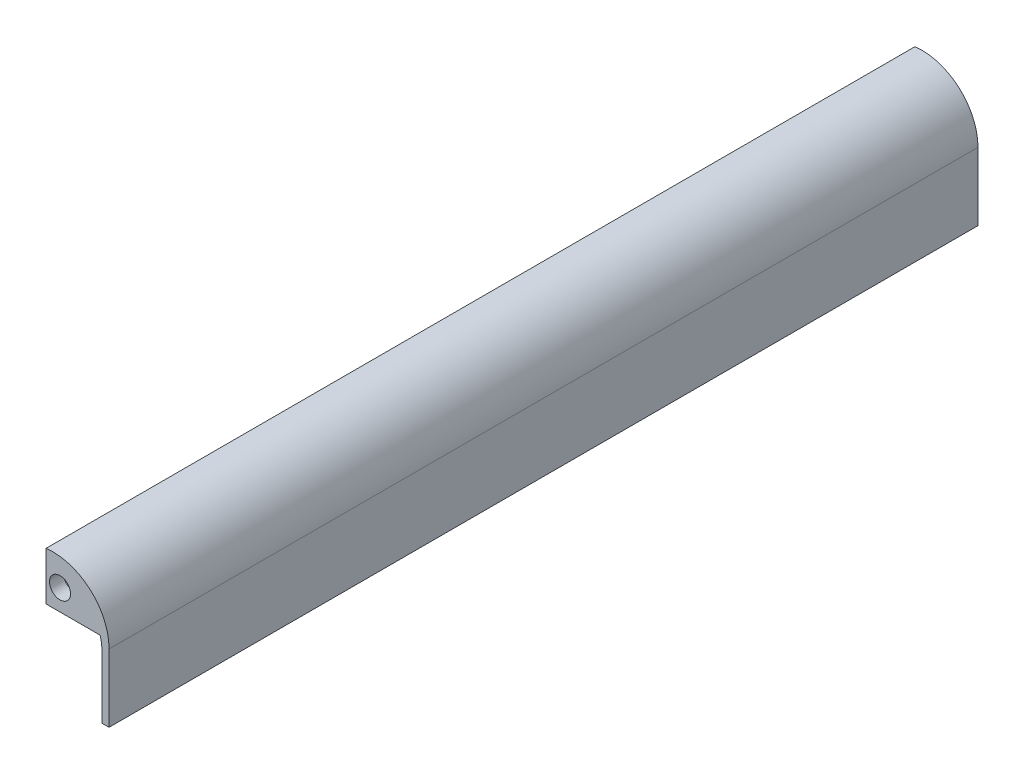
ISO-10303-21;
HEADER;
FILE_DESCRIPTION(('STEP AP214'),'2;1');
FILE_NAME('part.step','',(''),(''),'','','');
FILE_SCHEMA(('AUTOMOTIVE_DESIGN { 1 0 10303 214 1 1 1 1 }'));
ENDSEC;
DATA;
#1=APPLICATION_CONTEXT('core data for automotive mechanical design processes');
#2=APPLICATION_PROTOCOL_DEFINITION('international standard','automotive_design',2000,#1);
#3=PRODUCT_CONTEXT('',#1,'mechanical');
#4=PRODUCT('Part','Part','',(#3));
#5=PRODUCT_RELATED_PRODUCT_CATEGORY('part','',(#4));
#6=PRODUCT_DEFINITION_FORMATION('','',#4);
#7=PRODUCT_DEFINITION_CONTEXT('part definition',#1,'design');
#8=PRODUCT_DEFINITION('design','',#6,#7);
#9=PRODUCT_DEFINITION_SHAPE('','',#8);
#10=(LENGTH_UNIT() NAMED_UNIT(*) SI_UNIT(.MILLI.,.METRE.));
#11=(NAMED_UNIT(*) PLANE_ANGLE_UNIT() SI_UNIT($,.RADIAN.));
#12=(NAMED_UNIT(*) SI_UNIT($,.STERADIAN.) SOLID_ANGLE_UNIT());
#13=UNCERTAINTY_MEASURE_WITH_UNIT(LENGTH_MEASURE(1.E-05),#10,'distance_accuracy_value','');
#14=(GEOMETRIC_REPRESENTATION_CONTEXT(3) GLOBAL_UNCERTAINTY_ASSIGNED_CONTEXT((#13)) GLOBAL_UNIT_ASSIGNED_CONTEXT((#10,
#11,#12)) REPRESENTATION_CONTEXT('',''));
#15=CARTESIAN_POINT('',(0.,0.,0.));
#16=DIRECTION('',(0.,0.,1.));
#17=DIRECTION('',(1.,0.,0.));
#18=AXIS2_PLACEMENT_3D('',#15,#16,#17);
#19=CARTESIAN_POINT('',(0.,-114.3,1574.8));
#20=DIRECTION('',(0.,0.,-1.));
#21=DIRECTION('',(-1.,0.,0.));
#22=AXIS2_PLACEMENT_3D('',#19,#20,#21);
#23=CYLINDRICAL_SURFACE('',#22,101.6);
#24=CARTESIAN_POINT('',(0.,-114.3,1574.8));
#25=DIRECTION('',(0.,0.,1.));
#26=DIRECTION('',(1.,0.,0.));
#27=AXIS2_PLACEMENT_3D('',#24,#25,#26);
#28=CIRCLE('',#27,101.6);
#29=CARTESIAN_POINT('',(101.6,-114.3,1574.8));
#30=VERTEX_POINT('',#29);
#31=CARTESIAN_POINT('',(98.1456966537716,-88.0324872067063,1574.8));
#32=VERTEX_POINT('',#31);
#33=EDGE_CURVE('E150',#30,#32,#28,.T.);
#34=ORIENTED_EDGE('',*,*,#33,.T.);
#35=DIRECTION('',(0.,0.,-1.));
#36=VECTOR('',#35,1.);
#37=CARTESIAN_POINT('',(98.1456966537716,-88.0324872067063,1574.8));
#38=LINE('',#37,#36);
#39=CARTESIAN_POINT('',(98.1456966537716,-88.0324872067063,1549.4));
#40=VERTEX_POINT('',#39);
#41=EDGE_CURVE('E48',#32,#40,#38,.T.);
#42=ORIENTED_EDGE('',*,*,#41,.T.);
#43=CARTESIAN_POINT('',(0.,-114.3,1549.4));
#44=DIRECTION('',(0.,0.,-1.));
#45=DIRECTION('',(-1.,0.,0.));
#46=AXIS2_PLACEMENT_3D('',#43,#44,#45);
#47=CIRCLE('',#46,101.6);
#48=CARTESIAN_POINT('',(0.,-12.7,1549.4));
#49=VERTEX_POINT('',#48);
#50=EDGE_CURVE('E52',#49,#40,#47,.T.);
#51=ORIENTED_EDGE('',*,*,#50,.F.);
#52=DIRECTION('',(0.,0.,-1.));
#53=VECTOR('',#52,1.);
#54=CARTESIAN_POINT('',(0.,-12.7,1574.8));
#55=LINE('',#54,#53);
#56=CARTESIAN_POINT('',(0.,-12.7,25.4));
#57=VERTEX_POINT('',#56);
#58=EDGE_CURVE('E125',#49,#57,#55,.T.);
#59=ORIENTED_EDGE('',*,*,#58,.T.);
#60=CARTESIAN_POINT('',(0.,-114.3,25.4000000000001));
#61=DIRECTION('',(0.,0.,1.));
#62=DIRECTION('',(1.,0.,0.));
#63=AXIS2_PLACEMENT_3D('',#60,#61,#62);
#64=CIRCLE('',#63,101.6);
#65=CARTESIAN_POINT('',(98.1456966537716,-88.0324872067063,25.4000000000001));
#66=VERTEX_POINT('',#65);
#67=EDGE_CURVE('E146',#66,#57,#64,.T.);
#68=ORIENTED_EDGE('',*,*,#67,.F.);
#69=DIRECTION('',(0.,0.,-1.));
#70=VECTOR('',#69,1.);
#71=CARTESIAN_POINT('',(98.1456966537716,-88.0324872067063,1574.8));
#72=LINE('',#71,#70);
#73=CARTESIAN_POINT('',(98.1456966537716,-88.0324872067063,0.));
#74=VERTEX_POINT('',#73);
#75=EDGE_CURVE('E144',#74,#66,#72,.F.);
#76=ORIENTED_EDGE('',*,*,#75,.F.);
#77=CARTESIAN_POINT('',(0.,-114.3,0.));
#78=DIRECTION('',(0.,0.,1.));
#79=DIRECTION('',(1.,0.,0.));
#80=AXIS2_PLACEMENT_3D('',#77,#78,#79);
#81=CIRCLE('',#80,101.6);
#82=CARTESIAN_POINT('',(101.6,-114.3,0.));
#83=VERTEX_POINT('',#82);
#84=EDGE_CURVE('E149',#83,#74,#81,.T.);
#85=ORIENTED_EDGE('',*,*,#84,.F.);
#86=DIRECTION('',(0.,0.,-1.));
#87=VECTOR('',#86,1.);
#88=CARTESIAN_POINT('',(101.6,-114.3,1574.8));
#89=LINE('',#88,#87);
#90=EDGE_CURVE('E11',#30,#83,#89,.T.);
#91=ORIENTED_EDGE('',*,*,#90,.F.);
#92=EDGE_LOOP('',(#34,#42,#51,#59,#68,#76,#85,#91));
#93=FACE_BOUND('',#92,.T.);
#94=ADVANCED_FACE('F33',(#93),#23,.F.);
#95=CARTESIAN_POINT('',(101.6,0.,1574.8));
#96=DIRECTION('',(1.,0.,0.));
#97=DIRECTION('',(0.,0.,-1.));
#98=AXIS2_PLACEMENT_3D('',#95,#96,#97);
#99=PLANE('',#98);
#100=DIRECTION('',(0.,-1.,0.));
#101=VECTOR('',#100,1.);
#102=CARTESIAN_POINT('',(101.6,0.,0.));
#103=LINE('',#102,#101);
#104=CARTESIAN_POINT('',(101.6,-224.550826557987,0.));
#105=VERTEX_POINT('',#104);
#106=EDGE_CURVE('E165',#83,#105,#103,.T.);
#107=ORIENTED_EDGE('',*,*,#106,.T.);
#108=DIRECTION('',(0.,0.,-1.));
#109=VECTOR('',#108,1.);
#110=CARTESIAN_POINT('',(101.6,-224.550826557987,1574.8));
#111=LINE('',#110,#109);
#112=CARTESIAN_POINT('',(101.6,-224.550826557987,1574.8));
#113=VERTEX_POINT('',#112);
#114=EDGE_CURVE('E41',#113,#105,#111,.T.);
#115=ORIENTED_EDGE('',*,*,#114,.F.);
#116=DIRECTION('',(0.,-1.,0.));
#117=VECTOR('',#116,1.);
#118=CARTESIAN_POINT('',(101.6,0.,1574.8));
#119=LINE('',#118,#117);
#120=EDGE_CURVE('E152',#30,#113,#119,.T.);
#121=ORIENTED_EDGE('',*,*,#120,.F.);
#122=ORIENTED_EDGE('',*,*,#90,.T.);
#123=EDGE_LOOP('',(#107,#115,#121,#122));
#124=FACE_BOUND('',#123,.T.);
#125=ADVANCED_FACE('F211',(#124),#99,.F.);
#126=CARTESIAN_POINT('',(0.,-224.550826557987,1574.8));
#127=DIRECTION('',(0.,1.,0.));
#128=DIRECTION('',(0.,0.,1.));
#129=AXIS2_PLACEMENT_3D('',#126,#127,#128);
#130=PLANE('',#129);
#131=DIRECTION('',(1.,0.,0.));
#132=VECTOR('',#131,1.);
#133=CARTESIAN_POINT('',(0.,-224.550826557987,0.));
#134=LINE('',#133,#132);
#135=CARTESIAN_POINT('',(114.3,-224.550826557987,0.));
#136=VERTEX_POINT('',#135);
#137=EDGE_CURVE('E167',#105,#136,#134,.T.);
#138=ORIENTED_EDGE('',*,*,#137,.T.);
#139=DIRECTION('',(0.,0.,-1.));
#140=VECTOR('',#139,1.);
#141=CARTESIAN_POINT('',(114.3,-224.550826557987,1574.8));
#142=LINE('',#141,#140);
#143=CARTESIAN_POINT('',(114.3,-224.550826557987,1574.8));
#144=VERTEX_POINT('',#143);
#145=EDGE_CURVE('E181',#144,#136,#142,.T.);
#146=ORIENTED_EDGE('',*,*,#145,.F.);
#147=DIRECTION('',(1.,0.,0.));
#148=VECTOR('',#147,1.);
#149=CARTESIAN_POINT('',(0.,-224.550826557987,1574.8));
#150=LINE('',#149,#148);
#151=EDGE_CURVE('E155',#113,#144,#150,.T.);
#152=ORIENTED_EDGE('',*,*,#151,.F.);
#153=ORIENTED_EDGE('',*,*,#114,.T.);
#154=EDGE_LOOP('',(#138,#146,#152,#153));
#155=FACE_BOUND('',#154,.T.);
#156=ADVANCED_FACE('F189',(#155),#130,.F.);
#157=CARTESIAN_POINT('',(114.3,0.,1574.8));
#158=DIRECTION('',(-1.,0.,0.));
#159=DIRECTION('',(0.,-1.,0.));
#160=AXIS2_PLACEMENT_3D('',#157,#158,#159);
#161=PLANE('',#160);
#162=DIRECTION('',(0.,1.,0.));
#163=VECTOR('',#162,1.);
#164=CARTESIAN_POINT('',(114.3,0.,0.));
#165=LINE('',#164,#163);
#166=CARTESIAN_POINT('',(114.3,-101.6,0.));
#167=VERTEX_POINT('',#166);
#168=EDGE_CURVE('E169',#136,#167,#165,.T.);
#169=ORIENTED_EDGE('',*,*,#168,.T.);
#170=DIRECTION('',(0.,0.,-1.));
#171=VECTOR('',#170,1.);
#172=CARTESIAN_POINT('',(114.3,-101.6,1574.8));
#173=LINE('',#172,#171);
#174=CARTESIAN_POINT('',(114.3,-101.6,1574.8));
#175=VERTEX_POINT('',#174);
#176=EDGE_CURVE('E178',#175,#167,#173,.T.);
#177=ORIENTED_EDGE('',*,*,#176,.F.);
#178=DIRECTION('',(0.,1.,0.));
#179=VECTOR('',#178,1.);
#180=CARTESIAN_POINT('',(114.3,0.,1574.8));
#181=LINE('',#180,#179);
#182=EDGE_CURVE('E157',#144,#175,#181,.T.);
#183=ORIENTED_EDGE('',*,*,#182,.F.);
#184=ORIENTED_EDGE('',*,*,#145,.T.);
#185=EDGE_LOOP('',(#169,#177,#183,#184));
#186=FACE_BOUND('',#185,.T.);
#187=ADVANCED_FACE('F202',(#186),#161,.F.);
#188=CARTESIAN_POINT('',(12.7,-101.6,1574.8));
#189=DIRECTION('',(0.,0.,-1.));
#190=DIRECTION('',(-1.,0.,0.));
#191=AXIS2_PLACEMENT_3D('',#188,#189,#190);
#192=CYLINDRICAL_SURFACE('',#191,101.6);
#193=DIRECTION('',(0.,0.,-1.));
#194=VECTOR('',#193,1.);
#195=CARTESIAN_POINT('',(0.,-0.796875048439089,1574.8));
#196=LINE('',#195,#194);
#197=CARTESIAN_POINT('',(0.,-0.796875048439089,1574.8));
#198=VERTEX_POINT('',#197);
#199=CARTESIAN_POINT('',(0.,-0.796875048439089,0.));
#200=VERTEX_POINT('',#199);
#201=EDGE_CURVE('E176',#198,#200,#196,.T.);
#202=ORIENTED_EDGE('',*,*,#201,.F.);
#203=CARTESIAN_POINT('',(12.7,-101.6,1574.8));
#204=DIRECTION('',(0.,0.,1.));
#205=DIRECTION('',(1.,0.,0.));
#206=AXIS2_PLACEMENT_3D('',#203,#204,#205);
#207=CIRCLE('',#206,101.6);
#208=EDGE_CURVE('E159',#175,#198,#207,.T.);
#209=ORIENTED_EDGE('',*,*,#208,.F.);
#210=ORIENTED_EDGE('',*,*,#176,.T.);
#211=CARTESIAN_POINT('',(12.7,-101.6,0.));
#212=DIRECTION('',(0.,0.,1.));
#213=DIRECTION('',(1.,0.,0.));
#214=AXIS2_PLACEMENT_3D('',#211,#212,#213);
#215=CIRCLE('',#214,101.6);
#216=EDGE_CURVE('E171',#167,#200,#215,.T.);
#217=ORIENTED_EDGE('',*,*,#216,.T.);
#218=EDGE_LOOP('',(#202,#209,#210,#217));
#219=FACE_BOUND('',#218,.T.);
#220=ADVANCED_FACE('F207',(#219),#192,.T.);
#221=CARTESIAN_POINT('',(0.,0.,1574.8));
#222=DIRECTION('',(1.,0.,0.));
#223=DIRECTION('',(0.,1.,0.));
#224=AXIS2_PLACEMENT_3D('',#221,#222,#223);
#225=PLANE('',#224);
#226=ORIENTED_EDGE('',*,*,#58,.F.);
#227=DIRECTION('',(0.,1.,0.));
#228=VECTOR('',#227,1.);
#229=CARTESIAN_POINT('',(0.,-0.796875048439089,1549.4));
#230=LINE('',#229,#228);
#231=CARTESIAN_POINT('',(0.,-88.0324872067063,1549.4));
#232=VERTEX_POINT('',#231);
#233=EDGE_CURVE('E111',#232,#49,#230,.T.);
#234=ORIENTED_EDGE('',*,*,#233,.F.);
#235=DIRECTION('',(0.,0.,1.));
#236=VECTOR('',#235,1.);
#237=CARTESIAN_POINT('',(0.,-88.0324872067063,1549.4));
#238=LINE('',#237,#236);
#239=CARTESIAN_POINT('',(0.,-88.0324872067063,1574.8));
#240=VERTEX_POINT('',#239);
#241=EDGE_CURVE('E113',#232,#240,#238,.T.);
#242=ORIENTED_EDGE('',*,*,#241,.T.);
#243=DIRECTION('',(0.,-1.,0.));
#244=VECTOR('',#243,1.);
#245=CARTESIAN_POINT('',(0.,0.,1574.8));
#246=LINE('',#245,#244);
#247=EDGE_CURVE('E161',#198,#240,#246,.T.);
#248=ORIENTED_EDGE('',*,*,#247,.F.);
#249=ORIENTED_EDGE('',*,*,#201,.T.);
#250=DIRECTION('',(0.,-1.,0.));
#251=VECTOR('',#250,1.);
#252=CARTESIAN_POINT('',(0.,0.,0.));
#253=LINE('',#252,#251);
#254=CARTESIAN_POINT('',(0.,-88.0324872067063,0.));
#255=VERTEX_POINT('',#254);
#256=EDGE_CURVE('E153',#200,#255,#253,.T.);
#257=ORIENTED_EDGE('',*,*,#256,.T.);
#258=DIRECTION('',(0.,0.,-1.));
#259=VECTOR('',#258,1.);
#260=CARTESIAN_POINT('',(0.,-88.0324872067063,25.4));
#261=LINE('',#260,#259);
#262=CARTESIAN_POINT('',(0.,-88.0324872067063,25.4));
#263=VERTEX_POINT('',#262);
#264=EDGE_CURVE('E139',#263,#255,#261,.T.);
#265=ORIENTED_EDGE('',*,*,#264,.F.);
#266=DIRECTION('',(0.,1.,0.));
#267=VECTOR('',#266,1.);
#268=CARTESIAN_POINT('',(0.,-0.796875048439089,25.4));
#269=LINE('',#268,#267);
#270=EDGE_CURVE('E137',#263,#57,#269,.T.);
#271=ORIENTED_EDGE('',*,*,#270,.T.);
#272=EDGE_LOOP('',(#226,#234,#242,#248,#249,#257,#265,#271));
#273=FACE_BOUND('',#272,.T.);
#274=ADVANCED_FACE('F123',(#273),#225,.F.);
#275=CARTESIAN_POINT('',(0.,0.,1574.8));
#276=DIRECTION('',(0.,0.,1.));
#277=DIRECTION('',(1.,0.,0.));
#278=AXIS2_PLACEMENT_3D('',#275,#276,#277);
#279=PLANE('',#278);
#280=CARTESIAN_POINT('',(25.4,-49.9324872067063,1574.8));
#281=DIRECTION('',(0.,0.,-1.));
#282=DIRECTION('',(-1.,0.,0.));
#283=AXIS2_PLACEMENT_3D('',#280,#281,#282);
#284=CIRCLE('',#283,19.05);
#285=CARTESIAN_POINT('',(6.35,-49.9324872067063,1574.8));
#286=VERTEX_POINT('',#285);
#287=EDGE_CURVE('E255',#286,#286,#284,.T.);
#288=ORIENTED_EDGE('',*,*,#287,.T.);
#289=EDGE_LOOP('',(#288));
#290=FACE_BOUND('',#289,.T.);
#291=ORIENTED_EDGE('',*,*,#247,.T.);
#292=DIRECTION('',(-1.,0.,0.));
#293=VECTOR('',#292,1.);
#294=CARTESIAN_POINT('',(0.,-88.0324872067063,1574.8));
#295=LINE('',#294,#293);
#296=EDGE_CURVE('E119',#32,#240,#295,.T.);
#297=ORIENTED_EDGE('',*,*,#296,.F.);
#298=ORIENTED_EDGE('',*,*,#33,.F.);
#299=ORIENTED_EDGE('',*,*,#120,.T.);
#300=ORIENTED_EDGE('',*,*,#151,.T.);
#301=ORIENTED_EDGE('',*,*,#182,.T.);
#302=ORIENTED_EDGE('',*,*,#208,.T.);
#303=EDGE_LOOP('',(#291,#297,#298,#299,#300,#301,#302));
#304=FACE_BOUND('',#303,.T.);
#305=ADVANCED_FACE('F209',(#290,#304),#279,.T.);
#306=CARTESIAN_POINT('',(0.,0.,0.));
#307=DIRECTION('',(0.,0.,1.));
#308=DIRECTION('',(1.,0.,0.));
#309=AXIS2_PLACEMENT_3D('',#306,#307,#308);
#310=PLANE('',#309);
#311=CARTESIAN_POINT('',(25.4,-49.9324872067063,0.));
#312=DIRECTION('',(0.,0.,-1.));
#313=DIRECTION('',(-1.,0.,0.));
#314=AXIS2_PLACEMENT_3D('',#311,#312,#313);
#315=CIRCLE('',#314,19.05);
#316=CARTESIAN_POINT('',(6.35,-49.9324872067063,0.));
#317=VERTEX_POINT('',#316);
#318=EDGE_CURVE('E257',#317,#317,#315,.T.);
#319=ORIENTED_EDGE('',*,*,#318,.F.);
#320=EDGE_LOOP('',(#319));
#321=FACE_BOUND('',#320,.T.);
#322=ORIENTED_EDGE('',*,*,#84,.T.);
#323=DIRECTION('',(-1.,0.,0.));
#324=VECTOR('',#323,1.);
#325=CARTESIAN_POINT('',(0.,-88.0324872067063,0.));
#326=LINE('',#325,#324);
#327=EDGE_CURVE('E134',#74,#255,#326,.T.);
#328=ORIENTED_EDGE('',*,*,#327,.T.);
#329=ORIENTED_EDGE('',*,*,#256,.F.);
#330=ORIENTED_EDGE('',*,*,#216,.F.);
#331=ORIENTED_EDGE('',*,*,#168,.F.);
#332=ORIENTED_EDGE('',*,*,#137,.F.);
#333=ORIENTED_EDGE('',*,*,#106,.F.);
#334=EDGE_LOOP('',(#322,#328,#329,#330,#331,#332,#333));
#335=FACE_BOUND('',#334,.T.);
#336=ADVANCED_FACE('F196',(#321,#335),#310,.F.);
#337=CARTESIAN_POINT('',(0.,-88.0324872067063,25.4));
#338=DIRECTION('',(0.,-1.,0.));
#339=DIRECTION('',(0.,0.,-1.));
#340=AXIS2_PLACEMENT_3D('',#337,#338,#339);
#341=PLANE('',#340);
#342=ORIENTED_EDGE('',*,*,#327,.F.);
#343=ORIENTED_EDGE('',*,*,#75,.T.);
#344=DIRECTION('',(-1.,0.,0.));
#345=VECTOR('',#344,1.);
#346=CARTESIAN_POINT('',(0.,-88.0324872067063,25.4));
#347=LINE('',#346,#345);
#348=EDGE_CURVE('E135',#66,#263,#347,.T.);
#349=ORIENTED_EDGE('',*,*,#348,.T.);
#350=ORIENTED_EDGE('',*,*,#264,.T.);
#351=EDGE_LOOP('',(#342,#343,#349,#350));
#352=FACE_BOUND('',#351,.T.);
#353=ADVANCED_FACE('F216',(#352),#341,.T.);
#354=CARTESIAN_POINT('',(12.6999999999999,-101.6,25.4));
#355=DIRECTION('',(0.,0.,1.));
#356=DIRECTION('',(1.,0.,0.));
#357=AXIS2_PLACEMENT_3D('',#354,#355,#356);
#358=PLANE('',#357);
#359=CARTESIAN_POINT('',(25.4,-49.9324872067063,25.4000000000001));
#360=DIRECTION('',(0.,0.,1.));
#361=DIRECTION('',(1.,0.,0.));
#362=AXIS2_PLACEMENT_3D('',#359,#360,#361);
#363=CIRCLE('',#362,19.05);
#364=CARTESIAN_POINT('',(44.45,-49.9324872067063,25.4000000000001));
#365=VERTEX_POINT('',#364);
#366=EDGE_CURVE('E127',#365,#365,#363,.T.);
#367=ORIENTED_EDGE('',*,*,#366,.F.);
#368=EDGE_LOOP('',(#367));
#369=FACE_BOUND('',#368,.T.);
#370=ORIENTED_EDGE('',*,*,#348,.F.);
#371=ORIENTED_EDGE('',*,*,#67,.T.);
#372=ORIENTED_EDGE('',*,*,#270,.F.);
#373=EDGE_LOOP('',(#370,#371,#372));
#374=FACE_BOUND('',#373,.T.);
#375=ADVANCED_FACE('F220',(#369,#374),#358,.T.);
#376=CARTESIAN_POINT('',(0.,-88.0324872067063,1549.4));
#377=DIRECTION('',(0.,1.,0.));
#378=DIRECTION('',(0.,0.,1.));
#379=AXIS2_PLACEMENT_3D('',#376,#377,#378);
#380=PLANE('',#379);
#381=ORIENTED_EDGE('',*,*,#41,.F.);
#382=ORIENTED_EDGE('',*,*,#296,.T.);
#383=ORIENTED_EDGE('',*,*,#241,.F.);
#384=DIRECTION('',(-1.,0.,0.));
#385=VECTOR('',#384,1.);
#386=CARTESIAN_POINT('',(0.,-88.0324872067063,1549.4));
#387=LINE('',#386,#385);
#388=EDGE_CURVE('E107',#40,#232,#387,.T.);
#389=ORIENTED_EDGE('',*,*,#388,.F.);
#390=EDGE_LOOP('',(#381,#382,#383,#389));
#391=FACE_BOUND('',#390,.T.);
#392=ADVANCED_FACE('F117',(#391),#380,.F.);
#393=CARTESIAN_POINT('',(12.6999999999999,-101.6,1549.4));
#394=DIRECTION('',(0.,0.,-1.));
#395=DIRECTION('',(1.,0.,0.));
#396=AXIS2_PLACEMENT_3D('',#393,#394,#395);
#397=PLANE('',#396);
#398=CARTESIAN_POINT('',(25.4,-49.9324872067063,1549.4));
#399=DIRECTION('',(0.,0.,-1.));
#400=DIRECTION('',(-1.,0.,0.));
#401=AXIS2_PLACEMENT_3D('',#398,#399,#400);
#402=CIRCLE('',#401,19.05);
#403=CARTESIAN_POINT('',(6.35,-49.9324872067063,1549.4));
#404=VERTEX_POINT('',#403);
#405=EDGE_CURVE('E36',#404,#404,#402,.T.);
#406=ORIENTED_EDGE('',*,*,#405,.F.);
#407=EDGE_LOOP('',(#406));
#408=FACE_BOUND('',#407,.T.);
#409=ORIENTED_EDGE('',*,*,#233,.T.);
#410=ORIENTED_EDGE('',*,*,#50,.T.);
#411=ORIENTED_EDGE('',*,*,#388,.T.);
#412=EDGE_LOOP('',(#409,#410,#411));
#413=FACE_BOUND('',#412,.T.);
#414=ADVANCED_FACE('F109',(#408,#413),#397,.T.);
#415=CARTESIAN_POINT('',(25.4,-49.9324872067063,1574.8));
#416=DIRECTION('',(0.,0.,-1.));
#417=DIRECTION('',(-1.,0.,0.));
#418=AXIS2_PLACEMENT_3D('',#415,#416,#417);
#419=CYLINDRICAL_SURFACE('',#418,19.05);
#420=ORIENTED_EDGE('',*,*,#405,.T.);
#421=EDGE_LOOP('',(#420));
#422=FACE_BOUND('',#421,.T.);
#423=ORIENTED_EDGE('',*,*,#287,.F.);
#424=EDGE_LOOP('',(#423));
#425=FACE_BOUND('',#424,.T.);
#426=ADVANCED_FACE('F265',(#422,#425),#419,.F.);
#427=ORIENTED_EDGE('',*,*,#366,.T.);
#428=EDGE_LOOP('',(#427));
#429=FACE_BOUND('',#428,.T.);
#430=ORIENTED_EDGE('',*,*,#318,.T.);
#431=EDGE_LOOP('',(#430));
#432=FACE_BOUND('',#431,.T.);
#433=ADVANCED_FACE('F263',(#429,#432),#419,.F.);
#434=CLOSED_SHELL('',(#94,#125,#156,#187,#220,#274,#305,#336,#353,#375,#392,#414,#426,#433));
#435=MANIFOLD_SOLID_BREP('B2',#434);
#436=ADVANCED_BREP_SHAPE_REPRESENTATION('',(#18,#435),#14);
#437=SHAPE_DEFINITION_REPRESENTATION(#9,#436);
ENDSEC;
END-ISO-10303-21;
